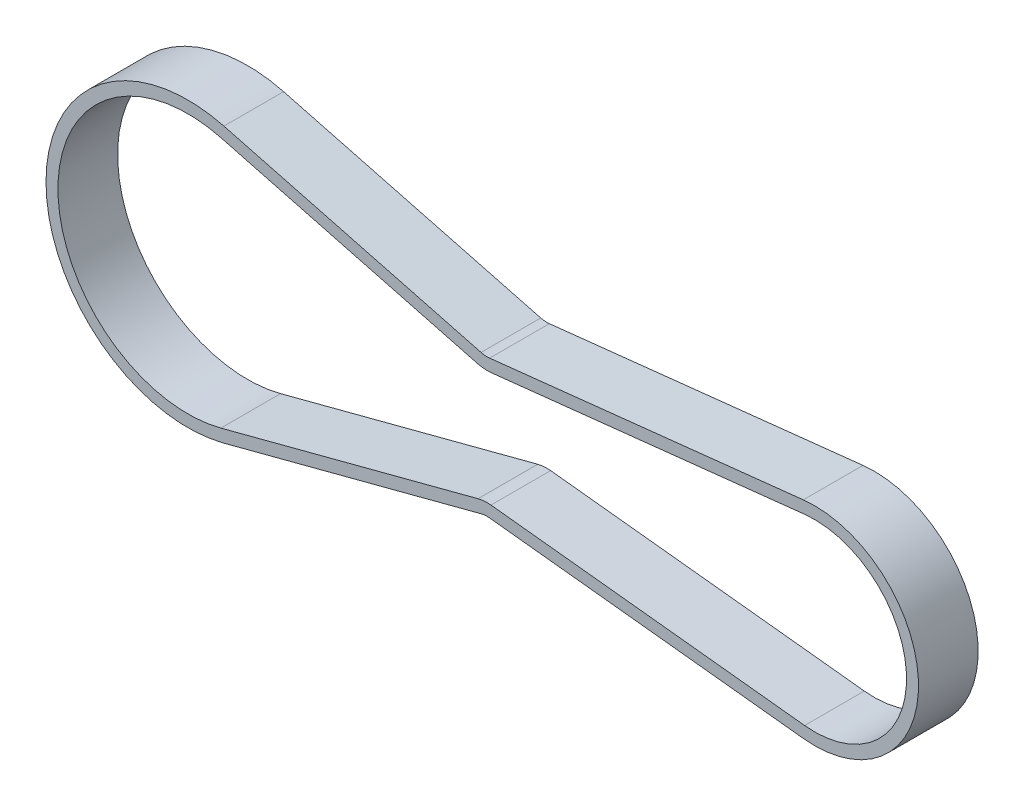
ISO-10303-21;
HEADER;
FILE_DESCRIPTION(('STEP AP214'),'2;1');
FILE_NAME('part.step','',(''),(''),'','','');
FILE_SCHEMA(('AUTOMOTIVE_DESIGN { 1 0 10303 214 1 1 1 1 }'));
ENDSEC;
DATA;
#1=APPLICATION_CONTEXT('core data for automotive mechanical design processes');
#2=APPLICATION_PROTOCOL_DEFINITION('international standard','automotive_design',2000,#1);
#3=PRODUCT_CONTEXT('',#1,'mechanical');
#4=PRODUCT('Part','Part','',(#3));
#5=PRODUCT_RELATED_PRODUCT_CATEGORY('part','',(#4));
#6=PRODUCT_DEFINITION_FORMATION('','',#4);
#7=PRODUCT_DEFINITION_CONTEXT('part definition',#1,'design');
#8=PRODUCT_DEFINITION('design','',#6,#7);
#9=PRODUCT_DEFINITION_SHAPE('','',#8);
#10=(LENGTH_UNIT() NAMED_UNIT(*) SI_UNIT(.MILLI.,.METRE.));
#11=(NAMED_UNIT(*) PLANE_ANGLE_UNIT() SI_UNIT($,.RADIAN.));
#12=(NAMED_UNIT(*) SI_UNIT($,.STERADIAN.) SOLID_ANGLE_UNIT());
#13=UNCERTAINTY_MEASURE_WITH_UNIT(LENGTH_MEASURE(1.E-05),#10,'distance_accuracy_value','');
#14=(GEOMETRIC_REPRESENTATION_CONTEXT(3) GLOBAL_UNCERTAINTY_ASSIGNED_CONTEXT((#13)) GLOBAL_UNIT_ASSIGNED_CONTEXT((#10,
#11,#12)) REPRESENTATION_CONTEXT('',''));
#15=CARTESIAN_POINT('',(0.,0.,0.));
#16=DIRECTION('',(0.,0.,1.));
#17=DIRECTION('',(1.,0.,0.));
#18=AXIS2_PLACEMENT_3D('',#15,#16,#17);
#19=CARTESIAN_POINT('',(49.3169011381621,-3.22658566531686E-13,66.5));
#20=DIRECTION('',(0.,0.,1.));
#21=DIRECTION('',(1.,0.,0.));
#22=AXIS2_PLACEMENT_3D('',#19,#20,#21);
#23=PLANE('',#22);
#24=CARTESIAN_POINT('',(0.,1.11022302462516E-13,66.5));
#25=DIRECTION('',(0.,0.,1.));
#26=DIRECTION('',(1.,0.,0.));
#27=AXIS2_PLACEMENT_3D('',#24,#25,#26);
#28=CIRCLE('',#27,21.7816920328653);
#29=CARTESIAN_POINT('',(5.52405414731105,21.0695736452395,66.5));
#30=VERTEX_POINT('',#29);
#31=CARTESIAN_POINT('',(5.52405414731106,-21.0695736452392,66.5));
#32=VERTEX_POINT('',#31);
#33=EDGE_CURVE('E185',#30,#32,#28,.T.);
#34=ORIENTED_EDGE('',*,*,#33,.F.);
#35=DIRECTION('',(0.967306562476804,-0.253609964688513,0.));
#36=VECTOR('',#35,1.);
#37=CARTESIAN_POINT('',(31.6828896700171,14.2112087684219,66.5));
#38=LINE('',#37,#36);
#39=CARTESIAN_POINT('',(48.6077837067843,9.77381327713993,66.5));
#40=VERTEX_POINT('',#39);
#41=EDGE_CURVE('E134',#30,#40,#38,.T.);
#42=ORIENTED_EDGE('',*,*,#41,.T.);
#43=CARTESIAN_POINT('',(50.1294434949154,15.5776526520008,66.5));
#44=DIRECTION('',(0.,0.,1.));
#45=DIRECTION('',(1.,0.,0.));
#46=AXIS2_PLACEMENT_3D('',#43,#44,#45);
#47=CIRCLE('',#46,6.);
#48=CARTESIAN_POINT('',(50.7777748619161,9.61278329563066,66.5));
#49=VERTEX_POINT('',#48);
#50=EDGE_CURVE('E125',#40,#49,#47,.T.);
#51=ORIENTED_EDGE('',*,*,#50,.T.);
#52=DIRECTION('',(0.994144892728349,0.10805522783345,0.));
#53=VECTOR('',#52,1.);
#54=CARTESIAN_POINT('',(73.0281437135452,12.0312121315355,66.5));
#55=LINE('',#54,#53);
#56=CARTESIAN_POINT('',(103.334275250255,15.3252349363627,66.5));
#57=VERTEX_POINT('',#56);
#58=EDGE_CURVE('E108',#49,#57,#55,.T.);
#59=ORIENTED_EDGE('',*,*,#58,.T.);
#60=CARTESIAN_POINT('',(105.,-1.0385950268487E-12,66.5));
#61=DIRECTION('',(0.,0.,1.));
#62=DIRECTION('',(1.,0.,0.));
#63=AXIS2_PLACEMENT_3D('',#60,#61,#62);
#64=CIRCLE('',#63,15.4154943091896);
#65=CARTESIAN_POINT('',(103.334275250255,-15.3252349363648,66.5));
#66=VERTEX_POINT('',#65);
#67=EDGE_CURVE('E267',#66,#57,#64,.T.);
#68=ORIENTED_EDGE('',*,*,#67,.F.);
#69=DIRECTION('',(0.994144892728345,-0.108055227833489,0.));
#70=VECTOR('',#69,1.);
#71=CARTESIAN_POINT('',(73.028143713545,-12.0312121315363,66.5));
#72=LINE('',#71,#70);
#73=CARTESIAN_POINT('',(50.7777748619163,-9.61278329563133,66.5));
#74=VERTEX_POINT('',#73);
#75=EDGE_CURVE('E179',#74,#66,#72,.T.);
#76=ORIENTED_EDGE('',*,*,#75,.F.);
#77=CARTESIAN_POINT('',(50.1294434949154,-15.5776526520015,66.5));
#78=DIRECTION('',(0.,0.,1.));
#79=DIRECTION('',(1.,0.,0.));
#80=AXIS2_PLACEMENT_3D('',#77,#78,#79);
#81=CIRCLE('',#80,6.);
#82=CARTESIAN_POINT('',(48.6077837067843,-9.77381327714058,66.5));
#83=VERTEX_POINT('',#82);
#84=EDGE_CURVE('E21',#74,#83,#81,.T.);
#85=ORIENTED_EDGE('',*,*,#84,.T.);
#86=DIRECTION('',(0.967306562476804,0.253609964688514,0.));
#87=VECTOR('',#86,1.);
#88=CARTESIAN_POINT('',(31.6828896700172,-14.2112087684218,66.5));
#89=LINE('',#88,#87);
#90=EDGE_CURVE('E28',#32,#83,#89,.T.);
#91=ORIENTED_EDGE('',*,*,#90,.F.);
#92=EDGE_LOOP('',(#34,#42,#51,#59,#68,#76,#85,#91));
#93=FACE_BOUND('',#92,.T.);
#94=DIRECTION('',(0.967306562476804,-0.253609964688514,0.));
#95=VECTOR('',#94,1.);
#96=CARTESIAN_POINT('',(25.4101756276448,17.9233957069585,66.5));
#97=LINE('',#96,#95);
#98=CARTESIAN_POINT('',(6.03127407668809,23.0041867701926,66.5));
#99=VERTEX_POINT('',#98);
#100=CARTESIAN_POINT('',(49.1150036361614,11.7084264020942,66.5));
#101=VERTEX_POINT('',#100);
#102=EDGE_CURVE('E168',#99,#101,#97,.T.);
#103=ORIENTED_EDGE('',*,*,#102,.F.);
#104=CARTESIAN_POINT('',(0.,-3.25371177841243E-13,66.5));
#105=DIRECTION('',(0.,0.,1.));
#106=DIRECTION('',(1.,0.,0.));
#107=AXIS2_PLACEMENT_3D('',#104,#105,#106);
#108=CIRCLE('',#107,23.7816920328653);
#109=CARTESIAN_POINT('',(6.03127407668814,-23.0041867701931,66.5));
#110=VERTEX_POINT('',#109);
#111=EDGE_CURVE('E153',#99,#110,#108,.T.);
#112=ORIENTED_EDGE('',*,*,#111,.T.);
#113=DIRECTION('',(0.967306562476804,0.253609964688514,0.));
#114=VECTOR('',#113,1.);
#115=CARTESIAN_POINT('',(25.410175627645,-17.9233957069585,66.5));
#116=LINE('',#115,#114);
#117=CARTESIAN_POINT('',(49.1150036361614,-11.7084264020942,66.5));
#118=VERTEX_POINT('',#117);
#119=EDGE_CURVE('E163',#110,#118,#116,.T.);
#120=ORIENTED_EDGE('',*,*,#119,.T.);
#121=CARTESIAN_POINT('',(50.1294434949154,-15.5776526520014,66.5));
#122=DIRECTION('',(0.,0.,1.));
#123=DIRECTION('',(1.,0.,0.));
#124=AXIS2_PLACEMENT_3D('',#121,#122,#123);
#125=CIRCLE('',#124,4.);
#126=CARTESIAN_POINT('',(50.5616644062494,-11.601073081088,66.5));
#127=VERTEX_POINT('',#126);
#128=EDGE_CURVE('E158',#127,#118,#125,.T.);
#129=ORIENTED_EDGE('',*,*,#128,.F.);
#130=DIRECTION('',(0.994144892728345,-0.108055227833489,0.));
#131=VECTOR('',#130,1.);
#132=CARTESIAN_POINT('',(79.0628901600433,-14.6989177362146,66.5));
#133=LINE('',#132,#131);
#134=CARTESIAN_POINT('',(103.118164794588,-17.3135247218215,66.5));
#135=VERTEX_POINT('',#134);
#136=EDGE_CURVE('E173',#127,#135,#133,.T.);
#137=ORIENTED_EDGE('',*,*,#136,.T.);
#138=CARTESIAN_POINT('',(105.,-1.03636149765536E-12,66.5));
#139=DIRECTION('',(0.,0.,1.));
#140=DIRECTION('',(1.,0.,0.));
#141=AXIS2_PLACEMENT_3D('',#138,#139,#140);
#142=CIRCLE('',#141,17.4154943091896);
#143=CARTESIAN_POINT('',(103.118164794588,17.3135247218194,66.5));
#144=VERTEX_POINT('',#143);
#145=EDGE_CURVE('E197',#135,#144,#142,.T.);
#146=ORIENTED_EDGE('',*,*,#145,.T.);
#147=DIRECTION('',(0.994144892728349,0.10805522783345,0.));
#148=VECTOR('',#147,1.);
#149=CARTESIAN_POINT('',(79.0628901600439,14.6989177362136,66.5));
#150=LINE('',#149,#148);
#151=CARTESIAN_POINT('',(50.5616644062492,11.6010730810874,66.5));
#152=VERTEX_POINT('',#151);
#153=EDGE_CURVE('E218',#152,#144,#150,.T.);
#154=ORIENTED_EDGE('',*,*,#153,.F.);
#155=CARTESIAN_POINT('',(50.1294434949154,15.5776526520008,66.5));
#156=DIRECTION('',(0.,0.,-1.));
#157=DIRECTION('',(1.,0.,0.));
#158=AXIS2_PLACEMENT_3D('',#155,#156,#157);
#159=CIRCLE('',#158,4.);
#160=EDGE_CURVE('E206',#152,#101,#159,.T.);
#161=ORIENTED_EDGE('',*,*,#160,.T.);
#162=EDGE_LOOP('',(#103,#112,#120,#129,#137,#146,#154,#161));
#163=FACE_BOUND('',#162,.T.);
#164=ADVANCED_FACE('F17',(#93,#163),#23,.T.);
#165=CARTESIAN_POINT('',(49.3169011381621,-3.22658566531686E-13,56.5));
#166=DIRECTION('',(0.,0.,1.));
#167=DIRECTION('',(1.,0.,0.));
#168=AXIS2_PLACEMENT_3D('',#165,#166,#167);
#169=PLANE('',#168);
#170=CARTESIAN_POINT('',(0.,1.11022302462516E-13,56.5));
#171=DIRECTION('',(0.,0.,1.));
#172=DIRECTION('',(1.,0.,0.));
#173=AXIS2_PLACEMENT_3D('',#170,#171,#172);
#174=CIRCLE('',#173,21.7816920328653);
#175=CARTESIAN_POINT('',(5.52405414731105,21.0695736452395,56.5));
#176=VERTEX_POINT('',#175);
#177=CARTESIAN_POINT('',(5.52405414731106,-21.0695736452392,56.5));
#178=VERTEX_POINT('',#177);
#179=EDGE_CURVE('E292',#176,#178,#174,.T.);
#180=ORIENTED_EDGE('',*,*,#179,.T.);
#181=DIRECTION('',(0.967306562476804,0.253609964688514,0.));
#182=VECTOR('',#181,1.);
#183=CARTESIAN_POINT('',(31.6828896700172,-14.2112087684218,56.5));
#184=LINE('',#183,#182);
#185=CARTESIAN_POINT('',(48.6077837067843,-9.77381327714058,56.5));
#186=VERTEX_POINT('',#185);
#187=EDGE_CURVE('E11',#178,#186,#184,.T.);
#188=ORIENTED_EDGE('',*,*,#187,.T.);
#189=CARTESIAN_POINT('',(50.1294434949154,-15.5776526520015,56.5));
#190=DIRECTION('',(0.,0.,1.));
#191=DIRECTION('',(1.,0.,0.));
#192=AXIS2_PLACEMENT_3D('',#189,#190,#191);
#193=CIRCLE('',#192,6.);
#194=CARTESIAN_POINT('',(50.7777748619163,-9.61278329563133,56.5));
#195=VERTEX_POINT('',#194);
#196=EDGE_CURVE('E230',#195,#186,#193,.T.);
#197=ORIENTED_EDGE('',*,*,#196,.F.);
#198=DIRECTION('',(0.994144892728345,-0.108055227833489,0.));
#199=VECTOR('',#198,1.);
#200=CARTESIAN_POINT('',(73.028143713545,-12.0312121315363,56.5));
#201=LINE('',#200,#199);
#202=CARTESIAN_POINT('',(103.334275250255,-15.3252349363648,56.5));
#203=VERTEX_POINT('',#202);
#204=EDGE_CURVE('E249',#195,#203,#201,.T.);
#205=ORIENTED_EDGE('',*,*,#204,.T.);
#206=CARTESIAN_POINT('',(105.,-1.0385950268487E-12,56.5));
#207=DIRECTION('',(0.,0.,1.));
#208=DIRECTION('',(1.,0.,0.));
#209=AXIS2_PLACEMENT_3D('',#206,#207,#208);
#210=CIRCLE('',#209,15.4154943091896);
#211=CARTESIAN_POINT('',(103.334275250255,15.3252349363627,56.5));
#212=VERTEX_POINT('',#211);
#213=EDGE_CURVE('E180',#203,#212,#210,.T.);
#214=ORIENTED_EDGE('',*,*,#213,.T.);
#215=DIRECTION('',(0.994144892728349,0.10805522783345,0.));
#216=VECTOR('',#215,1.);
#217=CARTESIAN_POINT('',(73.0281437135452,12.0312121315355,56.5));
#218=LINE('',#217,#216);
#219=CARTESIAN_POINT('',(50.7777748619161,9.61278329563066,56.5));
#220=VERTEX_POINT('',#219);
#221=EDGE_CURVE('E120',#220,#212,#218,.T.);
#222=ORIENTED_EDGE('',*,*,#221,.F.);
#223=CARTESIAN_POINT('',(50.1294434949154,15.5776526520008,56.5));
#224=DIRECTION('',(0.,0.,1.));
#225=DIRECTION('',(1.,0.,0.));
#226=AXIS2_PLACEMENT_3D('',#223,#224,#225);
#227=CIRCLE('',#226,6.);
#228=CARTESIAN_POINT('',(48.6077837067843,9.77381327713993,56.5));
#229=VERTEX_POINT('',#228);
#230=EDGE_CURVE('E127',#229,#220,#227,.T.);
#231=ORIENTED_EDGE('',*,*,#230,.F.);
#232=DIRECTION('',(0.967306562476804,-0.253609964688513,0.));
#233=VECTOR('',#232,1.);
#234=CARTESIAN_POINT('',(31.6828896700171,14.2112087684219,56.5));
#235=LINE('',#234,#233);
#236=EDGE_CURVE('E143',#176,#229,#235,.T.);
#237=ORIENTED_EDGE('',*,*,#236,.F.);
#238=EDGE_LOOP('',(#180,#188,#197,#205,#214,#222,#231,#237));
#239=FACE_BOUND('',#238,.T.);
#240=DIRECTION('',(0.967306562476804,-0.253609964688514,0.));
#241=VECTOR('',#240,1.);
#242=CARTESIAN_POINT('',(25.4101756276448,17.9233957069585,56.5));
#243=LINE('',#242,#241);
#244=CARTESIAN_POINT('',(6.03127407668809,23.0041867701926,56.5));
#245=VERTEX_POINT('',#244);
#246=CARTESIAN_POINT('',(49.1150036361614,11.7084264020942,56.5));
#247=VERTEX_POINT('',#246);
#248=EDGE_CURVE('E146',#245,#247,#243,.T.);
#249=ORIENTED_EDGE('',*,*,#248,.T.);
#250=CARTESIAN_POINT('',(50.1294434949154,15.5776526520008,56.5));
#251=DIRECTION('',(0.,0.,-1.));
#252=DIRECTION('',(1.,0.,0.));
#253=AXIS2_PLACEMENT_3D('',#250,#251,#252);
#254=CIRCLE('',#253,4.);
#255=CARTESIAN_POINT('',(50.5616644062492,11.6010730810874,56.5));
#256=VERTEX_POINT('',#255);
#257=EDGE_CURVE('E42',#256,#247,#254,.T.);
#258=ORIENTED_EDGE('',*,*,#257,.F.);
#259=DIRECTION('',(0.994144892728349,0.10805522783345,0.));
#260=VECTOR('',#259,1.);
#261=CARTESIAN_POINT('',(79.0628901600439,14.6989177362136,56.5));
#262=LINE('',#261,#260);
#263=CARTESIAN_POINT('',(103.118164794588,17.3135247218194,56.5));
#264=VERTEX_POINT('',#263);
#265=EDGE_CURVE('E207',#256,#264,#262,.T.);
#266=ORIENTED_EDGE('',*,*,#265,.T.);
#267=CARTESIAN_POINT('',(105.,-1.03636149765536E-12,56.5));
#268=DIRECTION('',(0.,0.,1.));
#269=DIRECTION('',(1.,0.,0.));
#270=AXIS2_PLACEMENT_3D('',#267,#268,#269);
#271=CIRCLE('',#270,17.4154943091896);
#272=CARTESIAN_POINT('',(103.118164794588,-17.3135247218215,56.5));
#273=VERTEX_POINT('',#272);
#274=EDGE_CURVE('E199',#273,#264,#271,.T.);
#275=ORIENTED_EDGE('',*,*,#274,.F.);
#276=DIRECTION('',(0.994144892728345,-0.108055227833489,0.));
#277=VECTOR('',#276,1.);
#278=CARTESIAN_POINT('',(79.0628901600433,-14.6989177362146,56.5));
#279=LINE('',#278,#277);
#280=CARTESIAN_POINT('',(50.5616644062494,-11.601073081088,56.5));
#281=VERTEX_POINT('',#280);
#282=EDGE_CURVE('E198',#281,#273,#279,.T.);
#283=ORIENTED_EDGE('',*,*,#282,.F.);
#284=CARTESIAN_POINT('',(50.1294434949154,-15.5776526520014,56.5));
#285=DIRECTION('',(0.,0.,1.));
#286=DIRECTION('',(1.,0.,0.));
#287=AXIS2_PLACEMENT_3D('',#284,#285,#286);
#288=CIRCLE('',#287,4.);
#289=CARTESIAN_POINT('',(49.1150036361614,-11.7084264020942,56.5));
#290=VERTEX_POINT('',#289);
#291=EDGE_CURVE('E174',#281,#290,#288,.T.);
#292=ORIENTED_EDGE('',*,*,#291,.T.);
#293=DIRECTION('',(0.967306562476804,0.253609964688514,0.));
#294=VECTOR('',#293,1.);
#295=CARTESIAN_POINT('',(25.410175627645,-17.9233957069585,56.5));
#296=LINE('',#295,#294);
#297=CARTESIAN_POINT('',(6.03127407668814,-23.0041867701931,56.5));
#298=VERTEX_POINT('',#297);
#299=EDGE_CURVE('E159',#298,#290,#296,.T.);
#300=ORIENTED_EDGE('',*,*,#299,.F.);
#301=CARTESIAN_POINT('',(0.,-3.25371177841243E-13,56.5));
#302=DIRECTION('',(0.,0.,1.));
#303=DIRECTION('',(1.,0.,0.));
#304=AXIS2_PLACEMENT_3D('',#301,#302,#303);
#305=CIRCLE('',#304,23.7816920328653);
#306=EDGE_CURVE('E148',#245,#298,#305,.T.);
#307=ORIENTED_EDGE('',*,*,#306,.F.);
#308=EDGE_LOOP('',(#249,#258,#266,#275,#283,#292,#300,#307));
#309=FACE_BOUND('',#308,.T.);
#310=ADVANCED_FACE('F330',(#239,#309),#169,.F.);
#311=CARTESIAN_POINT('',(31.6828896700172,-14.2112087684218,56.5));
#312=DIRECTION('',(0.253609964688514,-0.967306562476804,0.));
#313=DIRECTION('',(0.,0.,-1.));
#314=AXIS2_PLACEMENT_3D('',#311,#312,#313);
#315=PLANE('',#314);
#316=ORIENTED_EDGE('',*,*,#90,.T.);
#317=DIRECTION('',(0.,0.,1.));
#318=VECTOR('',#317,1.);
#319=CARTESIAN_POINT('',(48.6077837067843,-9.77381327714058,56.5));
#320=LINE('',#319,#318);
#321=EDGE_CURVE('E233',#186,#83,#320,.T.);
#322=ORIENTED_EDGE('',*,*,#321,.F.);
#323=ORIENTED_EDGE('',*,*,#187,.F.);
#324=DIRECTION('',(0.,0.,1.));
#325=VECTOR('',#324,1.);
#326=CARTESIAN_POINT('',(5.52405414731106,-21.0695736452392,56.5));
#327=LINE('',#326,#325);
#328=EDGE_CURVE('E189',#178,#32,#327,.T.);
#329=ORIENTED_EDGE('',*,*,#328,.T.);
#330=EDGE_LOOP('',(#316,#322,#323,#329));
#331=FACE_BOUND('',#330,.T.);
#332=ADVANCED_FACE('F390',(#331),#315,.F.);
#333=CARTESIAN_POINT('',(50.1294434949154,15.5776526520008,56.5));
#334=DIRECTION('',(0.,0.,1.));
#335=DIRECTION('',(1.,0.,0.));
#336=AXIS2_PLACEMENT_3D('',#333,#334,#335);
#337=CYLINDRICAL_SURFACE('',#336,4.);
#338=ORIENTED_EDGE('',*,*,#160,.F.);
#339=DIRECTION('',(0.,0.,1.));
#340=VECTOR('',#339,1.);
#341=CARTESIAN_POINT('',(50.5616644062492,11.6010730810874,56.5));
#342=LINE('',#341,#340);
#343=EDGE_CURVE('E203',#256,#152,#342,.T.);
#344=ORIENTED_EDGE('',*,*,#343,.F.);
#345=ORIENTED_EDGE('',*,*,#257,.T.);
#346=DIRECTION('',(0.,0.,1.));
#347=VECTOR('',#346,1.);
#348=CARTESIAN_POINT('',(49.1150036361614,11.7084264020942,56.5));
#349=LINE('',#348,#347);
#350=EDGE_CURVE('E164',#247,#101,#349,.T.);
#351=ORIENTED_EDGE('',*,*,#350,.T.);
#352=EDGE_LOOP('',(#338,#344,#345,#351));
#353=FACE_BOUND('',#352,.T.);
#354=ADVANCED_FACE('F19',(#353),#337,.F.);
#355=CARTESIAN_POINT('',(79.0628901600439,14.6989177362136,56.5));
#356=DIRECTION('',(0.10805522783345,-0.994144892728349,0.));
#357=DIRECTION('',(0.,0.,-1.));
#358=AXIS2_PLACEMENT_3D('',#355,#356,#357);
#359=PLANE('',#358);
#360=ORIENTED_EDGE('',*,*,#153,.T.);
#361=DIRECTION('',(0.,0.,1.));
#362=VECTOR('',#361,1.);
#363=CARTESIAN_POINT('',(103.118164794588,17.3135247218194,56.5));
#364=LINE('',#363,#362);
#365=EDGE_CURVE('E202',#264,#144,#364,.T.);
#366=ORIENTED_EDGE('',*,*,#365,.F.);
#367=ORIENTED_EDGE('',*,*,#265,.F.);
#368=ORIENTED_EDGE('',*,*,#343,.T.);
#369=EDGE_LOOP('',(#360,#366,#367,#368));
#370=FACE_BOUND('',#369,.T.);
#371=ADVANCED_FACE('F428',(#370),#359,.F.);
#372=CARTESIAN_POINT('',(105.,-1.03636149765536E-12,56.5));
#373=DIRECTION('',(0.,0.,1.));
#374=DIRECTION('',(1.,0.,0.));
#375=AXIS2_PLACEMENT_3D('',#372,#373,#374);
#376=CYLINDRICAL_SURFACE('',#375,17.4154943091896);
#377=ORIENTED_EDGE('',*,*,#145,.F.);
#378=DIRECTION('',(0.,0.,1.));
#379=VECTOR('',#378,1.);
#380=CARTESIAN_POINT('',(103.118164794588,-17.3135247218215,56.5));
#381=LINE('',#380,#379);
#382=EDGE_CURVE('E193',#273,#135,#381,.T.);
#383=ORIENTED_EDGE('',*,*,#382,.F.);
#384=ORIENTED_EDGE('',*,*,#274,.T.);
#385=ORIENTED_EDGE('',*,*,#365,.T.);
#386=EDGE_LOOP('',(#377,#383,#384,#385));
#387=FACE_BOUND('',#386,.T.);
#388=ADVANCED_FACE('F425',(#387),#376,.T.);
#389=CARTESIAN_POINT('',(79.0628901600433,-14.6989177362146,56.5));
#390=DIRECTION('',(-0.108055227833489,-0.994144892728345,0.));
#391=DIRECTION('',(-0.994144892728345,0.108055227833489,0.));
#392=AXIS2_PLACEMENT_3D('',#389,#390,#391);
#393=PLANE('',#392);
#394=ORIENTED_EDGE('',*,*,#136,.F.);
#395=DIRECTION('',(0.,0.,1.));
#396=VECTOR('',#395,1.);
#397=CARTESIAN_POINT('',(50.5616644062494,-11.601073081088,56.5));
#398=LINE('',#397,#396);
#399=EDGE_CURVE('E169',#281,#127,#398,.T.);
#400=ORIENTED_EDGE('',*,*,#399,.F.);
#401=ORIENTED_EDGE('',*,*,#282,.T.);
#402=ORIENTED_EDGE('',*,*,#382,.T.);
#403=EDGE_LOOP('',(#394,#400,#401,#402));
#404=FACE_BOUND('',#403,.T.);
#405=ADVANCED_FACE('F427',(#404),#393,.T.);
#406=CARTESIAN_POINT('',(50.1294434949154,-15.5776526520014,56.5));
#407=DIRECTION('',(0.,0.,1.));
#408=DIRECTION('',(1.,0.,0.));
#409=AXIS2_PLACEMENT_3D('',#406,#407,#408);
#410=CYLINDRICAL_SURFACE('',#409,4.);
#411=ORIENTED_EDGE('',*,*,#128,.T.);
#412=DIRECTION('',(0.,0.,1.));
#413=VECTOR('',#412,1.);
#414=CARTESIAN_POINT('',(49.1150036361614,-11.7084264020942,56.5));
#415=LINE('',#414,#413);
#416=EDGE_CURVE('E154',#290,#118,#415,.T.);
#417=ORIENTED_EDGE('',*,*,#416,.F.);
#418=ORIENTED_EDGE('',*,*,#291,.F.);
#419=ORIENTED_EDGE('',*,*,#399,.T.);
#420=EDGE_LOOP('',(#411,#417,#418,#419));
#421=FACE_BOUND('',#420,.T.);
#422=ADVANCED_FACE('F357',(#421),#410,.F.);
#423=CARTESIAN_POINT('',(25.410175627645,-17.9233957069585,56.5));
#424=DIRECTION('',(0.253609964688514,-0.967306562476804,0.));
#425=DIRECTION('',(0.,0.,-1.));
#426=AXIS2_PLACEMENT_3D('',#423,#424,#425);
#427=PLANE('',#426);
#428=ORIENTED_EDGE('',*,*,#119,.F.);
#429=DIRECTION('',(0.,0.,1.));
#430=VECTOR('',#429,1.);
#431=CARTESIAN_POINT('',(6.03127407668814,-23.0041867701931,56.5));
#432=LINE('',#431,#430);
#433=EDGE_CURVE('E152',#298,#110,#432,.T.);
#434=ORIENTED_EDGE('',*,*,#433,.F.);
#435=ORIENTED_EDGE('',*,*,#299,.T.);
#436=ORIENTED_EDGE('',*,*,#416,.T.);
#437=EDGE_LOOP('',(#428,#434,#435,#436));
#438=FACE_BOUND('',#437,.T.);
#439=ADVANCED_FACE('F361',(#438),#427,.T.);
#440=CARTESIAN_POINT('',(0.,-3.25371177841243E-13,56.5));
#441=DIRECTION('',(0.,0.,1.));
#442=DIRECTION('',(1.,0.,0.));
#443=AXIS2_PLACEMENT_3D('',#440,#441,#442);
#444=CYLINDRICAL_SURFACE('',#443,23.7816920328653);
#445=ORIENTED_EDGE('',*,*,#111,.F.);
#446=DIRECTION('',(0.,0.,1.));
#447=VECTOR('',#446,1.);
#448=CARTESIAN_POINT('',(6.03127407668809,23.0041867701926,56.5));
#449=LINE('',#448,#447);
#450=EDGE_CURVE('E184',#245,#99,#449,.T.);
#451=ORIENTED_EDGE('',*,*,#450,.F.);
#452=ORIENTED_EDGE('',*,*,#306,.T.);
#453=ORIENTED_EDGE('',*,*,#433,.T.);
#454=EDGE_LOOP('',(#445,#451,#452,#453));
#455=FACE_BOUND('',#454,.T.);
#456=ADVANCED_FACE('F364',(#455),#444,.T.);
#457=CARTESIAN_POINT('',(25.4101756276448,17.9233957069585,56.5));
#458=DIRECTION('',(-0.253609964688514,-0.967306562476804,0.));
#459=DIRECTION('',(-0.967306562476804,0.253609964688514,0.));
#460=AXIS2_PLACEMENT_3D('',#457,#458,#459);
#461=PLANE('',#460);
#462=ORIENTED_EDGE('',*,*,#102,.T.);
#463=ORIENTED_EDGE('',*,*,#350,.F.);
#464=ORIENTED_EDGE('',*,*,#248,.F.);
#465=ORIENTED_EDGE('',*,*,#450,.T.);
#466=EDGE_LOOP('',(#462,#463,#464,#465));
#467=FACE_BOUND('',#466,.T.);
#468=ADVANCED_FACE('F334',(#467),#461,.F.);
#469=CARTESIAN_POINT('',(50.1294434949154,-15.5776526520015,56.5));
#470=DIRECTION('',(0.,0.,1.));
#471=DIRECTION('',(1.,0.,0.));
#472=AXIS2_PLACEMENT_3D('',#469,#470,#471);
#473=CYLINDRICAL_SURFACE('',#472,6.);
#474=ORIENTED_EDGE('',*,*,#84,.F.);
#475=DIRECTION('',(0.,0.,1.));
#476=VECTOR('',#475,1.);
#477=CARTESIAN_POINT('',(50.7777748619163,-9.61278329563133,56.5));
#478=LINE('',#477,#476);
#479=EDGE_CURVE('E241',#195,#74,#478,.T.);
#480=ORIENTED_EDGE('',*,*,#479,.F.);
#481=ORIENTED_EDGE('',*,*,#196,.T.);
#482=ORIENTED_EDGE('',*,*,#321,.T.);
#483=EDGE_LOOP('',(#474,#480,#481,#482));
#484=FACE_BOUND('',#483,.T.);
#485=ADVANCED_FACE('F393',(#484),#473,.T.);
#486=CARTESIAN_POINT('',(73.028143713545,-12.0312121315363,56.5));
#487=DIRECTION('',(-0.108055227833489,-0.994144892728345,0.));
#488=DIRECTION('',(-0.994144892728345,0.108055227833489,0.));
#489=AXIS2_PLACEMENT_3D('',#486,#487,#488);
#490=PLANE('',#489);
#491=ORIENTED_EDGE('',*,*,#75,.T.);
#492=DIRECTION('',(0.,0.,1.));
#493=VECTOR('',#492,1.);
#494=CARTESIAN_POINT('',(103.334275250255,-15.3252349363648,56.5));
#495=LINE('',#494,#493);
#496=EDGE_CURVE('E175',#203,#66,#495,.T.);
#497=ORIENTED_EDGE('',*,*,#496,.F.);
#498=ORIENTED_EDGE('',*,*,#204,.F.);
#499=ORIENTED_EDGE('',*,*,#479,.T.);
#500=EDGE_LOOP('',(#491,#497,#498,#499));
#501=FACE_BOUND('',#500,.T.);
#502=ADVANCED_FACE('F394',(#501),#490,.F.);
#503=CARTESIAN_POINT('',(105.,-1.0385950268487E-12,56.5));
#504=DIRECTION('',(0.,0.,1.));
#505=DIRECTION('',(1.,0.,0.));
#506=AXIS2_PLACEMENT_3D('',#503,#504,#505);
#507=CYLINDRICAL_SURFACE('',#506,15.4154943091896);
#508=ORIENTED_EDGE('',*,*,#67,.T.);
#509=DIRECTION('',(0.,0.,1.));
#510=VECTOR('',#509,1.);
#511=CARTESIAN_POINT('',(103.334275250255,15.3252349363627,56.5));
#512=LINE('',#511,#510);
#513=EDGE_CURVE('E115',#212,#57,#512,.T.);
#514=ORIENTED_EDGE('',*,*,#513,.F.);
#515=ORIENTED_EDGE('',*,*,#213,.F.);
#516=ORIENTED_EDGE('',*,*,#496,.T.);
#517=EDGE_LOOP('',(#508,#514,#515,#516));
#518=FACE_BOUND('',#517,.T.);
#519=ADVANCED_FACE('F397',(#518),#507,.F.);
#520=CARTESIAN_POINT('',(73.0281437135452,12.0312121315355,56.5));
#521=DIRECTION('',(0.10805522783345,-0.994144892728349,0.));
#522=DIRECTION('',(0.,0.,-1.));
#523=AXIS2_PLACEMENT_3D('',#520,#521,#522);
#524=PLANE('',#523);
#525=ORIENTED_EDGE('',*,*,#58,.F.);
#526=DIRECTION('',(0.,0.,1.));
#527=VECTOR('',#526,1.);
#528=CARTESIAN_POINT('',(50.7777748619161,9.61278329563066,56.5));
#529=LINE('',#528,#527);
#530=EDGE_CURVE('E112',#220,#49,#529,.T.);
#531=ORIENTED_EDGE('',*,*,#530,.F.);
#532=ORIENTED_EDGE('',*,*,#221,.T.);
#533=ORIENTED_EDGE('',*,*,#513,.T.);
#534=EDGE_LOOP('',(#525,#531,#532,#533));
#535=FACE_BOUND('',#534,.T.);
#536=ADVANCED_FACE('F110',(#535),#524,.T.);
#537=CARTESIAN_POINT('',(50.1294434949154,15.5776526520008,56.5));
#538=DIRECTION('',(0.,0.,1.));
#539=DIRECTION('',(1.,0.,0.));
#540=AXIS2_PLACEMENT_3D('',#537,#538,#539);
#541=CYLINDRICAL_SURFACE('',#540,6.);
#542=ORIENTED_EDGE('',*,*,#50,.F.);
#543=DIRECTION('',(0.,0.,1.));
#544=VECTOR('',#543,1.);
#545=CARTESIAN_POINT('',(48.6077837067843,9.77381327713993,56.5));
#546=LINE('',#545,#544);
#547=EDGE_CURVE('E136',#229,#40,#546,.T.);
#548=ORIENTED_EDGE('',*,*,#547,.F.);
#549=ORIENTED_EDGE('',*,*,#230,.T.);
#550=ORIENTED_EDGE('',*,*,#530,.T.);
#551=EDGE_LOOP('',(#542,#548,#549,#550));
#552=FACE_BOUND('',#551,.T.);
#553=ADVANCED_FACE('F123',(#552),#541,.T.);
#554=CARTESIAN_POINT('',(31.6828896700171,14.2112087684219,56.5));
#555=DIRECTION('',(-0.253609964688513,-0.967306562476804,0.));
#556=DIRECTION('',(-0.967306562476804,0.253609964688513,0.));
#557=AXIS2_PLACEMENT_3D('',#554,#555,#556);
#558=PLANE('',#557);
#559=ORIENTED_EDGE('',*,*,#41,.F.);
#560=DIRECTION('',(0.,0.,1.));
#561=VECTOR('',#560,1.);
#562=CARTESIAN_POINT('',(5.52405414731105,21.0695736452395,56.5));
#563=LINE('',#562,#561);
#564=EDGE_CURVE('E285',#176,#30,#563,.T.);
#565=ORIENTED_EDGE('',*,*,#564,.F.);
#566=ORIENTED_EDGE('',*,*,#236,.T.);
#567=ORIENTED_EDGE('',*,*,#547,.T.);
#568=EDGE_LOOP('',(#559,#565,#566,#567));
#569=FACE_BOUND('',#568,.T.);
#570=ADVANCED_FACE('F379',(#569),#558,.T.);
#571=CARTESIAN_POINT('',(0.,1.11022302462516E-13,56.5));
#572=DIRECTION('',(0.,0.,1.));
#573=DIRECTION('',(1.,0.,0.));
#574=AXIS2_PLACEMENT_3D('',#571,#572,#573);
#575=CYLINDRICAL_SURFACE('',#574,21.7816920328653);
#576=ORIENTED_EDGE('',*,*,#33,.T.);
#577=ORIENTED_EDGE('',*,*,#328,.F.);
#578=ORIENTED_EDGE('',*,*,#179,.F.);
#579=ORIENTED_EDGE('',*,*,#564,.T.);
#580=EDGE_LOOP('',(#576,#577,#578,#579));
#581=FACE_BOUND('',#580,.T.);
#582=ADVANCED_FACE('F434',(#581),#575,.F.);
#583=CLOSED_SHELL('',(#164,#310,#332,#354,#371,#388,#405,#422,#439,#456,#468,#485,#502,#519,
#536,#553,#570,#582));
#584=MANIFOLD_SOLID_BREP('B1',#583);
#585=ADVANCED_BREP_SHAPE_REPRESENTATION('',(#18,#584),#14);
#586=SHAPE_DEFINITION_REPRESENTATION(#9,#585);
ENDSEC;
END-ISO-10303-21;
